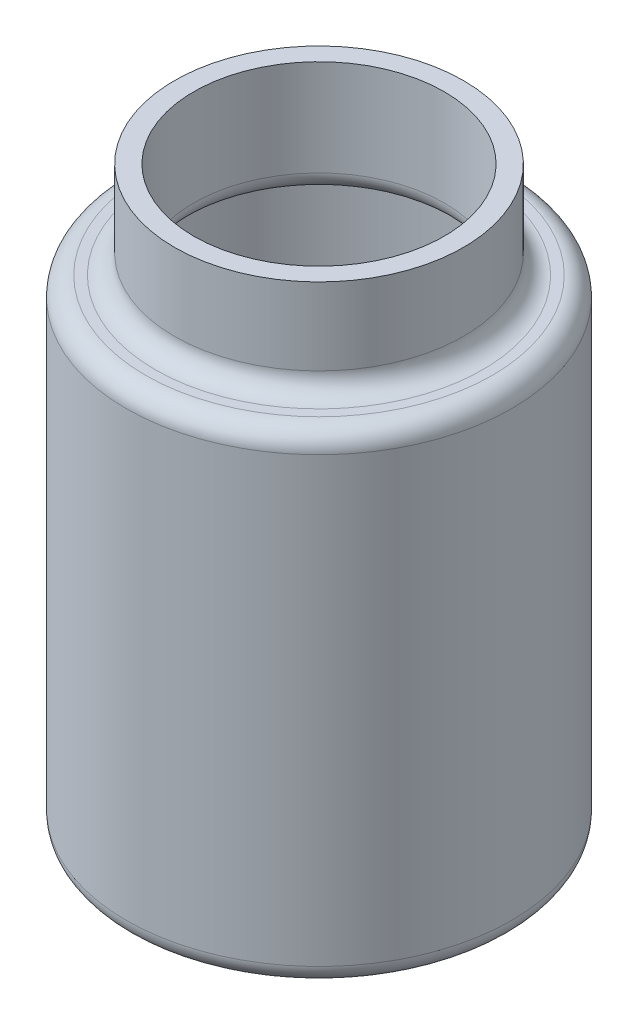
ISO-10303-21;
HEADER;
FILE_DESCRIPTION(('STEP AP214'),'2;1');
FILE_NAME('part.step','',(''),(''),'','','');
FILE_SCHEMA(('AUTOMOTIVE_DESIGN { 1 0 10303 214 1 1 1 1 }'));
ENDSEC;
DATA;
#1=APPLICATION_CONTEXT('core data for automotive mechanical design processes');
#2=APPLICATION_PROTOCOL_DEFINITION('international standard','automotive_design',2000,#1);
#3=PRODUCT_CONTEXT('',#1,'mechanical');
#4=PRODUCT('Part','Part','',(#3));
#5=PRODUCT_RELATED_PRODUCT_CATEGORY('part','',(#4));
#6=PRODUCT_DEFINITION_FORMATION('','',#4);
#7=PRODUCT_DEFINITION_CONTEXT('part definition',#1,'design');
#8=PRODUCT_DEFINITION('design','',#6,#7);
#9=PRODUCT_DEFINITION_SHAPE('','',#8);
#10=(LENGTH_UNIT() NAMED_UNIT(*) SI_UNIT(.MILLI.,.METRE.));
#11=(NAMED_UNIT(*) PLANE_ANGLE_UNIT() SI_UNIT($,.RADIAN.));
#12=(NAMED_UNIT(*) SI_UNIT($,.STERADIAN.) SOLID_ANGLE_UNIT());
#13=UNCERTAINTY_MEASURE_WITH_UNIT(LENGTH_MEASURE(1.E-05),#10,'distance_accuracy_value','');
#14=(GEOMETRIC_REPRESENTATION_CONTEXT(3) GLOBAL_UNCERTAINTY_ASSIGNED_CONTEXT((#13)) GLOBAL_UNIT_ASSIGNED_CONTEXT((#10,
#11,#12)) REPRESENTATION_CONTEXT('',''));
#15=CARTESIAN_POINT('',(0.,0.,0.));
#16=DIRECTION('',(0.,0.,1.));
#17=DIRECTION('',(1.,0.,0.));
#18=AXIS2_PLACEMENT_3D('',#15,#16,#17);
#19=CARTESIAN_POINT('',(0.,0.,0.));
#20=DIRECTION('',(0.,1.,0.));
#21=DIRECTION('',(0.,0.,1.));
#22=AXIS2_PLACEMENT_3D('',#19,#20,#21);
#23=PLANE('',#22);
#24=CARTESIAN_POINT('',(0.,0.,0.));
#25=DIRECTION('',(0.,1.,0.));
#26=DIRECTION('',(0.,0.,1.));
#27=AXIS2_PLACEMENT_3D('',#24,#25,#26);
#28=CIRCLE('',#27,9.);
#29=CARTESIAN_POINT('',(0.,0.,9.));
#30=VERTEX_POINT('',#29);
#31=EDGE_CURVE('E61',#30,#30,#28,.F.);
#32=ORIENTED_EDGE('',*,*,#31,.T.);
#33=EDGE_LOOP('',(#32));
#34=FACE_BOUND('',#33,.T.);
#35=ADVANCED_FACE('F37',(#34),#23,.F.);
#36=CARTESIAN_POINT('',(0.,30.,0.));
#37=DIRECTION('',(0.,-1.,0.));
#38=DIRECTION('',(0.,0.,-1.));
#39=AXIS2_PLACEMENT_3D('',#36,#37,#38);
#40=CYLINDRICAL_SURFACE('',#39,10.);
#41=CARTESIAN_POINT('',(0.,1.,0.));
#42=DIRECTION('',(0.,1.,0.));
#43=DIRECTION('',(0.,0.,1.));
#44=AXIS2_PLACEMENT_3D('',#41,#42,#43);
#45=CIRCLE('',#44,10.);
#46=CARTESIAN_POINT('',(0.,1.,10.));
#47=VERTEX_POINT('',#46);
#48=EDGE_CURVE('E50',#47,#47,#45,.T.);
#49=ORIENTED_EDGE('',*,*,#48,.T.);
#50=EDGE_LOOP('',(#49));
#51=FACE_BOUND('',#50,.T.);
#52=CARTESIAN_POINT('',(0.,24.,0.));
#53=DIRECTION('',(0.,-1.,0.));
#54=DIRECTION('',(0.,0.,-1.));
#55=AXIS2_PLACEMENT_3D('',#52,#53,#54);
#56=CIRCLE('',#55,10.);
#57=CARTESIAN_POINT('',(0.,24.,-10.));
#58=VERTEX_POINT('',#57);
#59=EDGE_CURVE('E55',#58,#58,#56,.T.);
#60=ORIENTED_EDGE('',*,*,#59,.T.);
#61=EDGE_LOOP('',(#60));
#62=FACE_BOUND('',#61,.T.);
#63=ADVANCED_FACE('F111',(#51,#62),#40,.T.);
#64=CARTESIAN_POINT('',(-7.5,25.,0.));
#65=DIRECTION('',(0.,-1.,0.));
#66=DIRECTION('',(0.,0.,-1.));
#67=AXIS2_PLACEMENT_3D('',#64,#65,#66);
#68=PLANE('',#67);
#69=CARTESIAN_POINT('',(0.,25.,0.));
#70=DIRECTION('',(0.,-1.,0.));
#71=DIRECTION('',(0.,0.,-1.));
#72=AXIS2_PLACEMENT_3D('',#69,#70,#71);
#73=CIRCLE('',#72,8.5);
#74=CARTESIAN_POINT('',(0.,25.,-8.5));
#75=VERTEX_POINT('',#74);
#76=EDGE_CURVE('E69',#75,#75,#73,.T.);
#77=ORIENTED_EDGE('',*,*,#76,.T.);
#78=EDGE_LOOP('',(#77));
#79=FACE_BOUND('',#78,.T.);
#80=CARTESIAN_POINT('',(0.,25.,0.));
#81=DIRECTION('',(0.,-1.,0.));
#82=DIRECTION('',(0.,0.,-1.));
#83=AXIS2_PLACEMENT_3D('',#80,#81,#82);
#84=CIRCLE('',#83,9.);
#85=CARTESIAN_POINT('',(0.,25.,-9.));
#86=VERTEX_POINT('',#85);
#87=EDGE_CURVE('E73',#86,#86,#84,.F.);
#88=ORIENTED_EDGE('',*,*,#87,.T.);
#89=EDGE_LOOP('',(#88));
#90=FACE_BOUND('',#89,.T.);
#91=ADVANCED_FACE('F117',(#79,#90),#68,.F.);
#92=CARTESIAN_POINT('',(0.,30.,0.));
#93=DIRECTION('',(0.,-1.,0.));
#94=DIRECTION('',(0.,0.,-1.));
#95=AXIS2_PLACEMENT_3D('',#92,#93,#94);
#96=CYLINDRICAL_SURFACE('',#95,7.5);
#97=CARTESIAN_POINT('',(0.,26.,0.));
#98=DIRECTION('',(0.,-1.,0.));
#99=DIRECTION('',(0.,0.,-1.));
#100=AXIS2_PLACEMENT_3D('',#97,#98,#99);
#101=CIRCLE('',#100,7.5);
#102=CARTESIAN_POINT('',(0.,26.,-7.5));
#103=VERTEX_POINT('',#102);
#104=EDGE_CURVE('E65',#103,#103,#101,.F.);
#105=ORIENTED_EDGE('',*,*,#104,.T.);
#106=EDGE_LOOP('',(#105));
#107=FACE_BOUND('',#106,.T.);
#108=CARTESIAN_POINT('',(0.,30.,0.));
#109=DIRECTION('',(0.,-1.,0.));
#110=DIRECTION('',(0.,0.,-1.));
#111=AXIS2_PLACEMENT_3D('',#108,#109,#110);
#112=CIRCLE('',#111,7.5);
#113=CARTESIAN_POINT('',(0.,30.,-7.5));
#114=VERTEX_POINT('',#113);
#115=EDGE_CURVE('E77',#114,#114,#112,.T.);
#116=ORIENTED_EDGE('',*,*,#115,.T.);
#117=EDGE_LOOP('',(#116));
#118=FACE_BOUND('',#117,.T.);
#119=ADVANCED_FACE('F107',(#107,#118),#96,.T.);
#120=CARTESIAN_POINT('',(0.,30.,0.));
#121=DIRECTION('',(0.,-1.,0.));
#122=DIRECTION('',(0.,0.,-1.));
#123=AXIS2_PLACEMENT_3D('',#120,#121,#122);
#124=PLANE('',#123);
#125=CARTESIAN_POINT('',(0.,30.,0.));
#126=DIRECTION('',(0.,-1.,0.));
#127=DIRECTION('',(0.,0.,-1.));
#128=AXIS2_PLACEMENT_3D('',#125,#126,#127);
#129=CIRCLE('',#128,6.5);
#130=CARTESIAN_POINT('',(0.,30.,-6.5));
#131=VERTEX_POINT('',#130);
#132=EDGE_CURVE('E82',#131,#131,#129,.T.);
#133=ORIENTED_EDGE('',*,*,#132,.T.);
#134=EDGE_LOOP('',(#133));
#135=FACE_BOUND('',#134,.T.);
#136=ORIENTED_EDGE('',*,*,#115,.F.);
#137=EDGE_LOOP('',(#136));
#138=FACE_BOUND('',#137,.T.);
#139=ADVANCED_FACE('F99',(#135,#138),#124,.F.);
#140=CARTESIAN_POINT('',(0.,0.999999999999999,0.));
#141=DIRECTION('',(0.,1.,0.));
#142=DIRECTION('',(0.,0.,1.));
#143=AXIS2_PLACEMENT_3D('',#140,#141,#142);
#144=PLANE('',#143);
#145=CARTESIAN_POINT('',(0.,1.,0.));
#146=DIRECTION('',(0.,1.,0.));
#147=DIRECTION('',(0.,0.,1.));
#148=AXIS2_PLACEMENT_3D('',#145,#146,#147);
#149=CIRCLE('',#148,9.);
#150=CARTESIAN_POINT('',(0.,1.,9.));
#151=VERTEX_POINT('',#150);
#152=EDGE_CURVE('E81',#151,#151,#149,.F.);
#153=ORIENTED_EDGE('',*,*,#152,.F.);
#154=EDGE_LOOP('',(#153));
#155=FACE_BOUND('',#154,.T.);
#156=ADVANCED_FACE('F97',(#155),#144,.T.);
#157=CARTESIAN_POINT('',(0.,30.,0.));
#158=DIRECTION('',(0.,-1.,0.));
#159=DIRECTION('',(0.,0.,-1.));
#160=AXIS2_PLACEMENT_3D('',#157,#158,#159);
#161=CYLINDRICAL_SURFACE('',#160,9.);
#162=ORIENTED_EDGE('',*,*,#152,.T.);
#163=EDGE_LOOP('',(#162));
#164=FACE_BOUND('',#163,.T.);
#165=CARTESIAN_POINT('',(0.,24.,0.));
#166=DIRECTION('',(0.,-1.,0.));
#167=DIRECTION('',(0.,0.,-1.));
#168=AXIS2_PLACEMENT_3D('',#165,#166,#167);
#169=CIRCLE('',#168,9.);
#170=CARTESIAN_POINT('',(0.,24.,-9.));
#171=VERTEX_POINT('',#170);
#172=EDGE_CURVE('E86',#171,#171,#169,.T.);
#173=ORIENTED_EDGE('',*,*,#172,.F.);
#174=EDGE_LOOP('',(#173));
#175=FACE_BOUND('',#174,.T.);
#176=ADVANCED_FACE('F94',(#164,#175),#161,.F.);
#177=CARTESIAN_POINT('',(-7.5,24.,0.));
#178=DIRECTION('',(0.,-1.,0.));
#179=DIRECTION('',(0.,0.,-1.));
#180=AXIS2_PLACEMENT_3D('',#177,#178,#179);
#181=PLANE('',#180);
#182=CARTESIAN_POINT('',(0.,24.,0.));
#183=DIRECTION('',(0.,-1.,0.));
#184=DIRECTION('',(0.,0.,-1.));
#185=AXIS2_PLACEMENT_3D('',#182,#183,#184);
#186=CIRCLE('',#185,7.5);
#187=CARTESIAN_POINT('',(0.,24.,-7.5));
#188=VERTEX_POINT('',#187);
#189=EDGE_CURVE('E10',#188,#188,#186,.F.);
#190=ORIENTED_EDGE('',*,*,#189,.T.);
#191=EDGE_LOOP('',(#190));
#192=FACE_BOUND('',#191,.T.);
#193=ORIENTED_EDGE('',*,*,#172,.T.);
#194=EDGE_LOOP('',(#193));
#195=FACE_BOUND('',#194,.T.);
#196=ADVANCED_FACE('F105',(#192,#195),#181,.T.);
#197=CARTESIAN_POINT('',(0.,30.,0.));
#198=DIRECTION('',(0.,-1.,0.));
#199=DIRECTION('',(0.,0.,-1.));
#200=AXIS2_PLACEMENT_3D('',#197,#198,#199);
#201=CYLINDRICAL_SURFACE('',#200,6.5);
#202=CARTESIAN_POINT('',(0.,25.,0.));
#203=DIRECTION('',(0.,-1.,0.));
#204=DIRECTION('',(0.,0.,-1.));
#205=AXIS2_PLACEMENT_3D('',#202,#203,#204);
#206=CIRCLE('',#205,6.5);
#207=CARTESIAN_POINT('',(0.,25.,-6.5));
#208=VERTEX_POINT('',#207);
#209=EDGE_CURVE('E45',#208,#208,#206,.T.);
#210=ORIENTED_EDGE('',*,*,#209,.T.);
#211=EDGE_LOOP('',(#210));
#212=FACE_BOUND('',#211,.T.);
#213=ORIENTED_EDGE('',*,*,#132,.F.);
#214=EDGE_LOOP('',(#213));
#215=FACE_BOUND('',#214,.T.);
#216=ADVANCED_FACE('F126',(#212,#215),#201,.F.);
#217=CARTESIAN_POINT('',(0.,26.,0.));
#218=DIRECTION('',(0.,-1.,0.));
#219=DIRECTION('',(0.,0.,-1.));
#220=AXIS2_PLACEMENT_3D('',#217,#218,#219);
#221=TOROIDAL_SURFACE('',#220,8.5,1.);
#222=ORIENTED_EDGE('',*,*,#104,.F.);
#223=EDGE_LOOP('',(#222));
#224=FACE_BOUND('',#223,.T.);
#225=ORIENTED_EDGE('',*,*,#76,.F.);
#226=EDGE_LOOP('',(#225));
#227=FACE_BOUND('',#226,.T.);
#228=ADVANCED_FACE('F122',(#224,#227),#221,.F.);
#229=CARTESIAN_POINT('',(0.,1.,0.));
#230=DIRECTION('',(0.,1.,0.));
#231=DIRECTION('',(0.,0.,1.));
#232=AXIS2_PLACEMENT_3D('',#229,#230,#231);
#233=TOROIDAL_SURFACE('',#232,9.,1.);
#234=ORIENTED_EDGE('',*,*,#48,.F.);
#235=EDGE_LOOP('',(#234));
#236=FACE_BOUND('',#235,.T.);
#237=ORIENTED_EDGE('',*,*,#31,.F.);
#238=EDGE_LOOP('',(#237));
#239=FACE_BOUND('',#238,.T.);
#240=ADVANCED_FACE('F125',(#236,#239),#233,.T.);
#241=CARTESIAN_POINT('',(0.,24.,0.));
#242=DIRECTION('',(0.,-1.,0.));
#243=DIRECTION('',(0.,0.,-1.));
#244=AXIS2_PLACEMENT_3D('',#241,#242,#243);
#245=TOROIDAL_SURFACE('',#244,9.,1.);
#246=ORIENTED_EDGE('',*,*,#87,.F.);
#247=EDGE_LOOP('',(#246));
#248=FACE_BOUND('',#247,.T.);
#249=ORIENTED_EDGE('',*,*,#59,.F.);
#250=EDGE_LOOP('',(#249));
#251=FACE_BOUND('',#250,.T.);
#252=ADVANCED_FACE('F129',(#248,#251),#245,.T.);
#253=CARTESIAN_POINT('',(0.,25.,0.));
#254=DIRECTION('',(0.,-1.,0.));
#255=DIRECTION('',(0.,0.,-1.));
#256=AXIS2_PLACEMENT_3D('',#253,#254,#255);
#257=TOROIDAL_SURFACE('',#256,7.5,1.);
#258=ORIENTED_EDGE('',*,*,#189,.F.);
#259=EDGE_LOOP('',(#258));
#260=FACE_BOUND('',#259,.T.);
#261=ORIENTED_EDGE('',*,*,#209,.F.);
#262=EDGE_LOOP('',(#261));
#263=FACE_BOUND('',#262,.T.);
#264=ADVANCED_FACE('F39',(#260,#263),#257,.T.);
#265=CLOSED_SHELL('',(#35,#63,#91,#119,#139,#156,#176,#196,#216,#228,#240,#252,#264));
#266=MANIFOLD_SOLID_BREP('B2',#265);
#267=ADVANCED_BREP_SHAPE_REPRESENTATION('',(#18,#266),#14);
#268=SHAPE_DEFINITION_REPRESENTATION(#9,#267);
ENDSEC;
END-ISO-10303-21;
